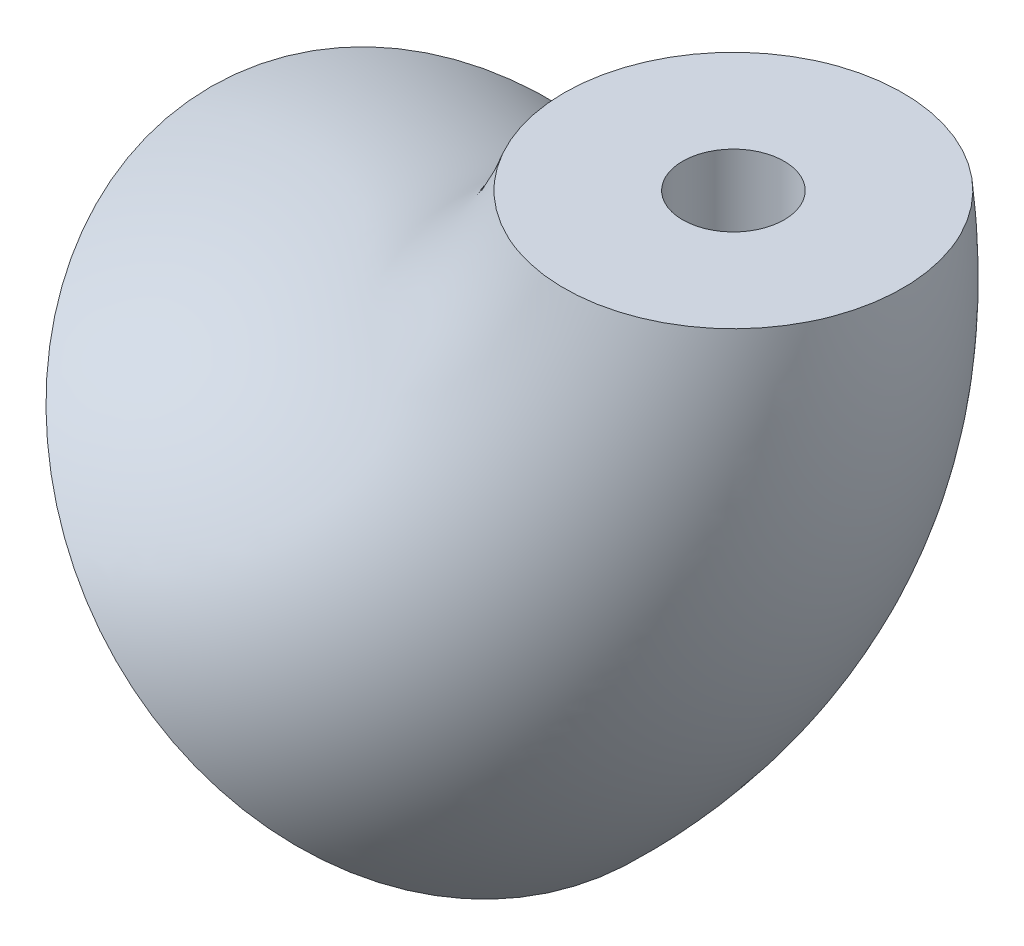
ISO-10303-21;
HEADER;
FILE_DESCRIPTION(('STEP AP214'),'2;1');
FILE_NAME('part.step','',(''),(''),'','','');
FILE_SCHEMA(('AUTOMOTIVE_DESIGN { 1 0 10303 214 1 1 1 1 }'));
ENDSEC;
DATA;
#1=APPLICATION_CONTEXT('core data for automotive mechanical design processes');
#2=APPLICATION_PROTOCOL_DEFINITION('international standard','automotive_design',2000,#1);
#3=PRODUCT_CONTEXT('',#1,'mechanical');
#4=PRODUCT('Part','Part','',(#3));
#5=PRODUCT_RELATED_PRODUCT_CATEGORY('part','',(#4));
#6=PRODUCT_DEFINITION_FORMATION('','',#4);
#7=PRODUCT_DEFINITION_CONTEXT('part definition',#1,'design');
#8=PRODUCT_DEFINITION('design','',#6,#7);
#9=PRODUCT_DEFINITION_SHAPE('','',#8);
#10=(LENGTH_UNIT() NAMED_UNIT(*) SI_UNIT(.MILLI.,.METRE.));
#11=(NAMED_UNIT(*) PLANE_ANGLE_UNIT() SI_UNIT($,.RADIAN.));
#12=(NAMED_UNIT(*) SI_UNIT($,.STERADIAN.) SOLID_ANGLE_UNIT());
#13=UNCERTAINTY_MEASURE_WITH_UNIT(LENGTH_MEASURE(1.E-05),#10,'distance_accuracy_value','');
#14=(GEOMETRIC_REPRESENTATION_CONTEXT(3) GLOBAL_UNCERTAINTY_ASSIGNED_CONTEXT((#13)) GLOBAL_UNIT_ASSIGNED_CONTEXT((#10,
#11,#12)) REPRESENTATION_CONTEXT('',''));
#15=CARTESIAN_POINT('',(0.,0.,0.));
#16=DIRECTION('',(0.,0.,1.));
#17=DIRECTION('',(1.,0.,0.));
#18=AXIS2_PLACEMENT_3D('',#15,#16,#17);
#19=CARTESIAN_POINT('',(1146.04163059245,750.255315422821,0.));
#20=DIRECTION('',(-0.731353701619166,-0.681998360062503,0.));
#21=DIRECTION('',(0.681998360062503,-0.731353701619166,0.));
#22=AXIS2_PLACEMENT_3D('',#19,#20,#21);
#23=PLANE('',#22);
#24=CARTESIAN_POINT('',(1146.04163059245,750.255315422821,0.));
#25=DIRECTION('',(-0.731353701619166,-0.681998360062503,0.));
#26=DIRECTION('',(0.681998360062503,-0.731353701619166,0.));
#27=AXIS2_PLACEMENT_3D('',#24,#25,#26);
#28=CIRCLE('',#27,9.21282401216281);
#29=CARTESIAN_POINT('',(1139.75849972461,756.993148366482,0.));
#30=VERTEX_POINT('',#29);
#31=EDGE_CURVE('E12',#30,#30,#28,.T.);
#32=ORIENTED_EDGE('',*,*,#31,.T.);
#33=EDGE_LOOP('',(#32));
#34=FACE_BOUND('',#33,.T.);
#35=ADVANCED_FACE('F103',(#34),#23,.T.);
#36=CARTESIAN_POINT('',(1155.18967768319,762.053259300769,0.));
#37=DIRECTION('',(0.,1.,0.));
#38=DIRECTION('',(0.,0.,1.));
#39=AXIS2_PLACEMENT_3D('',#36,#37,#38);
#40=PLANE('',#39);
#41=CARTESIAN_POINT('',(1155.18967768319,762.053259300769,0.));
#42=DIRECTION('',(0.,1.,0.));
#43=DIRECTION('',(0.,0.,1.));
#44=AXIS2_PLACEMENT_3D('',#41,#42,#43);
#45=CIRCLE('',#44,1.50000000000008);
#46=CARTESIAN_POINT('',(1155.18967768319,762.053259300769,1.50000000000008));
#47=VERTEX_POINT('',#46);
#48=EDGE_CURVE('E180',#47,#47,#45,.T.);
#49=ORIENTED_EDGE('',*,*,#48,.F.);
#50=EDGE_LOOP('',(#49));
#51=FACE_BOUND('',#50,.T.);
#52=CARTESIAN_POINT('',(1155.18967768319,762.053259300769,0.));
#53=DIRECTION('',(0.,1.,0.));
#54=DIRECTION('',(0.,0.,1.));
#55=AXIS2_PLACEMENT_3D('',#52,#53,#54);
#56=CIRCLE('',#55,4.99999999999982);
#57=CARTESIAN_POINT('',(1150.18967768319,762.053259300769,0.));
#58=VERTEX_POINT('',#57);
#59=EDGE_CURVE('E112',#58,#58,#56,.T.);
#60=ORIENTED_EDGE('',*,*,#59,.T.);
#61=EDGE_LOOP('',(#60));
#62=FACE_BOUND('',#61,.T.);
#63=ADVANCED_FACE('F136',(#51,#62),#40,.T.);
#64=CARTESIAN_POINT('',(1150.18967768319,762.053259300769,0.));
#65=CARTESIAN_POINT('',(1148.70749142818,757.778321869257,0.));
#66=CARTESIAN_POINT('',(1144.03343715613,755.510962111479,0.));
#67=CARTESIAN_POINT('',(1139.75849972461,756.993148366482,0.));
#68=CARTESIAN_POINT('',(1150.18967768319,762.053259300769,-0.654498464275008));
#69=CARTESIAN_POINT('',(1148.70749142818,757.778321869257,-0.838317587356443));
#70=CARTESIAN_POINT('',(1144.03343715613,755.510962111479,-1.02213671043788));
#71=CARTESIAN_POINT('',(1139.75849972461,756.993148366482,-1.20595583351932));
#72=CARTESIAN_POINT('',(1150.44970455818,762.053259300769,-1.96322622308587));
#73=CARTESIAN_POINT('',(1149.00920544388,757.717101960966,-2.51461963943124));
#74=CARTESIAN_POINT('',(1144.38804091517,755.335150493375,-3.0660130557766));
#75=CARTESIAN_POINT('',(1140.08526091517,756.642739890079,-3.61740647212197));
#76=CARTESIAN_POINT('',(1151.56202851706,762.05325930077,-3.62771208725002));
#77=CARTESIAN_POINT('',(1150.28960582695,757.425876070856,-4.64657999396316));
#78=CARTESIAN_POINT('',(1145.87852748238,754.552554457447,-5.66544790067631));
#79=CARTESIAN_POINT('',(1141.48308749716,755.143754401509,-6.68431580738946));
#80=CARTESIAN_POINT('',(1153.22632705192,762.053259300769,-4.73979573179859));
#81=CARTESIAN_POINT('',(1152.19833484904,756.970112175774,-6.07100526231663));
#82=CARTESIAN_POINT('',(1148.09050065559,753.360824709295,-7.40221479283468));
#83=CARTESIAN_POINT('',(1143.57446018439,752.901031770733,-8.73342432335272));
#84=CARTESIAN_POINT('',(1155.18967768319,762.05325930077,-5.13036592541417));
#85=CARTESIAN_POINT('',(1154.44627961897,756.42170422953,-6.57124353258663));
#86=CARTESIAN_POINT('',(1150.69025518008,751.943778007674,-8.0121211397591));
#87=CARTESIAN_POINT('',(1146.04163059245,750.255315422817,-9.45299874693156));
#88=CARTESIAN_POINT('',(1157.15302831445,762.053259300768,-4.73979573179842));
#89=CARTESIAN_POINT('',(1156.69422438889,755.873296283288,-6.07100526231648));
#90=CARTESIAN_POINT('',(1153.29000970458,750.526731306061,-7.40221479283455));
#91=CARTESIAN_POINT('',(1148.50880100052,747.609599074916,-8.73342432335262));
#92=CARTESIAN_POINT('',(1158.81732684932,762.05325930077,-3.62771208725009));
#93=CARTESIAN_POINT('',(1158.60295341098,755.417532388204,-4.64657999396326));
#94=CARTESIAN_POINT('',(1155.50198287779,749.335001557901,-5.66544790067643));
#95=CARTESIAN_POINT('',(1150.60017368774,745.366876444126,-6.6843158073896));
#96=CARTESIAN_POINT('',(1159.92965080818,762.053259300768,-1.96322622308575));
#97=CARTESIAN_POINT('',(1159.88335379405,755.126306498096,-2.51461963943113));
#98=CARTESIAN_POINT('',(1156.992469445,748.552405521979,-3.06601305577652));
#99=CARTESIAN_POINT('',(1151.99800026974,743.867890955567,-3.6174064721219));
#100=CARTESIAN_POINT('',(1160.18967768319,762.053259300769,-0.654498464275007));
#101=CARTESIAN_POINT('',(1160.18506780975,755.065086589804,-0.838317587356443));
#102=CARTESIAN_POINT('',(1157.34707320404,748.376593903873,-1.02213671043788));
#103=CARTESIAN_POINT('',(1152.32476146029,743.51748247916,-1.20595583351932));
#104=CARTESIAN_POINT('',(1160.18967768319,762.053259300769,0.654498464274996));
#105=CARTESIAN_POINT('',(1160.18506780975,755.065086589804,0.838317587356443));
#106=CARTESIAN_POINT('',(1157.34707320404,748.376593903873,1.02213671043788));
#107=CARTESIAN_POINT('',(1152.32476146029,743.51748247916,1.20595583351933));
#108=CARTESIAN_POINT('',(1159.92965080819,762.05325930077,1.96322622308566));
#109=CARTESIAN_POINT('',(1159.88335379405,755.126306498096,2.51461963943108));
#110=CARTESIAN_POINT('',(1156.992469445,748.552405521978,3.0660130557765));
#111=CARTESIAN_POINT('',(1151.99800026973,743.867890955564,3.61740647212193));
#112=CARTESIAN_POINT('',(1158.81732684932,762.053259300768,3.62771208725022));
#113=CARTESIAN_POINT('',(1158.60295341098,755.417532388204,4.64657999396331));
#114=CARTESIAN_POINT('',(1155.50198287779,749.335001557903,5.6654479006764));
#115=CARTESIAN_POINT('',(1150.60017368774,745.366876444129,6.68431580738949));
#116=CARTESIAN_POINT('',(1157.15302831445,762.05325930077,4.73979573179819));
#117=CARTESIAN_POINT('',(1156.69422438889,755.873296283289,6.07100526231633));
#118=CARTESIAN_POINT('',(1153.29000970458,750.52673130606,7.40221479283447));
#119=CARTESIAN_POINT('',(1148.50880100052,747.609599074913,8.73342432335262));
#120=CARTESIAN_POINT('',(1155.18967768319,762.05325930077,5.1303659254143));
#121=CARTESIAN_POINT('',(1154.44627961897,756.42170422953,6.57124353258674));
#122=CARTESIAN_POINT('',(1150.69025518008,751.943778007675,8.01212113975916));
#123=CARTESIAN_POINT('',(1146.04163059245,750.255315422819,9.4529987469316));
#124=CARTESIAN_POINT('',(1153.22632705192,762.053259300768,4.73979573179824));
#125=CARTESIAN_POINT('',(1152.19833484904,756.970112175773,6.07100526231634));
#126=CARTESIAN_POINT('',(1148.09050065559,753.360824709294,7.40221479283444));
#127=CARTESIAN_POINT('',(1143.57446018439,752.901031770732,8.73342432335254));
#128=CARTESIAN_POINT('',(1151.56202851705,762.053259300769,3.62771208725031));
#129=CARTESIAN_POINT('',(1150.28960582695,757.425876070856,4.64657999396335));
#130=CARTESIAN_POINT('',(1145.87852748238,754.552554457448,5.66544790067639));
#131=CARTESIAN_POINT('',(1141.48308749716,755.14375440151,6.68431580738943));
#132=CARTESIAN_POINT('',(1150.44970455819,762.053259300769,1.96322622308577));
#133=CARTESIAN_POINT('',(1149.00920544388,757.717101960966,2.51461963943118));
#134=CARTESIAN_POINT('',(1144.38804091517,755.335150493374,3.06601305577659));
#135=CARTESIAN_POINT('',(1140.08526091517,756.642739890078,3.617406472122));
#136=CARTESIAN_POINT('',(1150.18967768319,762.053259300769,0.654498464274995));
#137=CARTESIAN_POINT('',(1148.70749142818,757.778321869257,0.838317587356443));
#138=CARTESIAN_POINT('',(1144.03343715613,755.510962111479,1.02213671043788));
#139=CARTESIAN_POINT('',(1139.75849972461,756.993148366482,1.20595583351933));
#140=CARTESIAN_POINT('',(1150.18967768319,762.053259300769,0.));
#141=CARTESIAN_POINT('',(1148.70749142818,757.778321869257,0.));
#142=CARTESIAN_POINT('',(1144.03343715613,755.510962111479,0.));
#143=CARTESIAN_POINT('',(1139.75849972461,756.993148366482,0.));
#144=B_SPLINE_SURFACE_WITH_KNOTS('',3,3,((#64,#65,#66,#67),(#68,#69,#70,#71),(#72,#73,#74,#75),
(#76,#77,#78,#79),(#80,#81,#82,#83),(#84,#85,#86,#87),(#88,#89,#90,#91),(#92,#93,#94,#95),(#96,
#97,#98,#99),(#100,#101,#102,#103),(#104,#105,#106,#107),(#108,#109,#110,#111),(#112,#113,#114,
#115),(#116,#117,#118,#119),(#120,#121,#122,#123),(#124,#125,#126,#127),(#128,#129,#130,#131),
(#132,#133,#134,#135),(#136,#137,#138,#139),(#140,#141,#142,#143)),.UNSPECIFIED.,.T.,.F.,.F.,(4,
1,1,1,1,1,1,1,2,1,1,1,1,1,1,1,4),(4,4),(0.,0.0625,0.125,0.1875,0.25,0.3125,0.375,0.4375,0.5,
0.5625,0.625,0.6875,0.75,0.8125,0.875,0.9375,1.),(0.,1.),.UNSPECIFIED.);
#145=CARTESIAN_POINT('',(1150.18967768319,762.053259300769,0.));
#146=CARTESIAN_POINT('',(1150.18389212913,762.036572539112,0.));
#147=CARTESIAN_POINT('',(1150.17805369045,762.019904112294,0.));
#148=CARTESIAN_POINT('',(1150.16627968007,761.986628787414,0.));
#149=CARTESIAN_POINT('',(1150.16034426145,761.970021835186,0.));
#150=CARTESIAN_POINT('',(1150.1483767199,761.936869667366,0.));
#151=CARTESIAN_POINT('',(1150.14234474749,761.92032439744,0.));
#152=CARTESIAN_POINT('',(1150.13018452952,761.887295802029,0.));
#153=CARTESIAN_POINT('',(1150.12405643193,761.870812422065,0.));
#154=CARTESIAN_POINT('',(1150.11170439409,761.837907814373,0.));
#155=CARTESIAN_POINT('',(1150.10548059928,761.821486532045,0.));
#156=CARTESIAN_POINT('',(1150.09293759764,761.788706327392,0.));
#157=CARTESIAN_POINT('',(1150.08661853375,761.77234735037,0.));
#158=CARTESIAN_POINT('',(1150.07388542451,761.739691964072,0.));
#159=CARTESIAN_POINT('',(1150.06747151962,761.723395500026,0.));
#160=CARTESIAN_POINT('',(1150.05454915895,761.690865347402,0.));
#161=CARTESIAN_POINT('',(1150.04804084116,761.674631604002,0.));
#162=CARTESIAN_POINT('',(1150.03493008522,761.642227100367,0.));
#163=CARTESIAN_POINT('',(1150.02832778264,761.626056285282,0.));
#164=CARTESIAN_POINT('',(1150.01502948761,761.593777845953,0.));
#165=CARTESIAN_POINT('',(1150.00833362833,761.577670166852,0.));
#166=CARTESIAN_POINT('',(1149.99484865038,761.545518207146,0.));
#167=CARTESIAN_POINT('',(1149.98805966249,761.529473871697,0.));
#168=CARTESIAN_POINT('',(1149.9743888578,761.497448806929,0.));
#169=CARTESIAN_POINT('',(1149.9675071694,761.481468022801,0.));
#170=CARTESIAN_POINT('',(1149.95365139414,761.449570268287,0.));
#171=CARTESIAN_POINT('',(1149.94667743333,761.433653243147,0.));
#172=CARTESIAN_POINT('',(1149.93263754367,761.401883214201,0.));
#173=CARTESIAN_POINT('',(1149.92557173855,761.386030155716,0.));
#174=CARTESIAN_POINT('',(1149.91134859066,761.354388267654,0.));
#175=CARTESIAN_POINT('',(1149.90419136933,761.338599383492,0.));
#176=CARTESIAN_POINT('',(1149.88978581938,761.307086051627,0.));
#177=CARTESIAN_POINT('',(1149.88253760993,761.291361549454,0.));
#178=CARTESIAN_POINT('',(1149.86795051409,761.259977189102,0.));
#179=CARTESIAN_POINT('',(1149.86061174462,761.244317276583,0.));
#180=CARTESIAN_POINT('',(1149.84584395907,761.213062303057,0.));
#181=CARTESIAN_POINT('',(1149.83841505768,761.197467187859,0.));
#182=CARTESIAN_POINT('',(1149.82346743859,761.166342016472,0.));
#183=CARTESIAN_POINT('',(1149.81594883337,761.15081190626,0.));
#184=CARTESIAN_POINT('',(1149.80082223691,761.119816952325,0.));
#185=CARTESIAN_POINT('',(1149.79321435597,761.104352054764,0.));
#186=CARTESIAN_POINT('',(1149.7779096383,761.073487733596,0.));
#187=CARTESIAN_POINT('',(1149.77021290973,761.05808825635,0.));
#188=CARTESIAN_POINT('',(1149.75473092703,761.027354983259,0.));
#189=CARTESIAN_POINT('',(1149.74694577894,761.012021133993,0.));
#190=CARTESIAN_POINT('',(1149.73128738737,760.981419324293,0.));
#191=CARTESIAN_POINT('',(1149.72341424785,760.96615131067,0.));
#192=CARTESIAN_POINT('',(1149.70758030359,760.935681379673,0.));
#193=CARTESIAN_POINT('',(1149.69961960073,760.920479409357,0.));
#194=CARTESIAN_POINT('',(1149.68361095995,760.890141772374,0.));
#195=CARTESIAN_POINT('',(1149.67556312186,760.875006053028,0.));
#196=CARTESIAN_POINT('',(1149.65938064073,760.84480112537,0.));
#197=CARTESIAN_POINT('',(1149.6512460955,760.829731864657,0.));
#198=CARTESIAN_POINT('',(1149.63489063018,760.799660061636,0.));
#199=CARTESIAN_POINT('',(1149.62666980591,760.784657467218,0.));
#200=CARTESIAN_POINT('',(1149.61014221258,760.754719204145,0.));
#201=CARTESIAN_POINT('',(1149.60183553737,760.739783483684,0.));
#202=CARTESIAN_POINT('',(1149.5851366722,760.70997917587,0.));
#203=CARTESIAN_POINT('',(1149.57674457414,760.695110537027,0.));
#204=CARTESIAN_POINT('',(1149.55987529329,760.665440599782,0.));
#205=CARTESIAN_POINT('',(1149.55139820049,760.650639250219,0.));
#206=CARTESIAN_POINT('',(1149.53435936013,760.621104098853,0.));
#207=CARTESIAN_POINT('',(1149.52579770067,760.606370246231,0.));
#208=CARTESIAN_POINT('',(1149.50859015698,760.576970296054,0.));
#209=CARTESIAN_POINT('',(1149.49994435897,760.562304148033,0.));
#210=CARTESIAN_POINT('',(1149.48256896811,760.533039814355,0.));
#211=CARTESIAN_POINT('',(1149.47383945964,760.518441578596,0.));
#212=CARTESIAN_POINT('',(1149.45629707778,760.489313276726,0.));
#213=CARTESIAN_POINT('',(1149.44748428695,760.47478316089,0.));
#214=CARTESIAN_POINT('',(1149.42977577025,760.445791306137,0.));
#215=CARTESIAN_POINT('',(1149.42088012516,760.431329517882,0.));
#216=CARTESIAN_POINT('',(1149.4030063298,760.402474525555,0.));
#217=CARTESIAN_POINT('',(1149.39402825854,760.388081272541,0.));
#218=CARTESIAN_POINT('',(1149.37599004067,760.35936355795,0.));
#219=CARTESIAN_POINT('',(1149.36692997134,760.345039047835,0.));
#220=CARTESIAN_POINT('',(1149.34872818715,760.316459026288,0.));
#221=CARTESIAN_POINT('',(1149.33958654785,760.302203466732,0.));
#222=CARTESIAN_POINT('',(1149.32122205349,760.273761553537,0.));
#223=CARTESIAN_POINT('',(1149.3119992723,760.259575152199,0.));
#224=CARTESIAN_POINT('',(1149.29347292395,760.231271762664,0.));
#225=CARTESIAN_POINT('',(1149.28416942898,760.217154727201,0.));
#226=CARTESIAN_POINT('',(1149.26548208279,760.188990276634,0.));
#227=CARTESIAN_POINT('',(1149.25609830214,760.174942814704,0.));
#228=CARTESIAN_POINT('',(1149.23725081428,760.146917718414,0.));
#229=CARTESIAN_POINT('',(1149.22778717604,760.132940037675,0.));
#230=CARTESIAN_POINT('',(1149.20878040268,760.105054710969,0.));
#231=CARTESIAN_POINT('',(1149.19923733495,760.091147019078,0.));
#232=CARTESIAN_POINT('',(1149.18007213225,760.063401877263,0.));
#233=CARTESIAN_POINT('',(1149.17045006312,760.049564381878,0.));
#234=CARTESIAN_POINT('',(1149.15112728725,760.021959840261,0.));
#235=CARTESIAN_POINT('',(1149.14142664481,760.008192749038,0.));
#236=CARTESIAN_POINT('',(1149.12194715194,759.980729222927,0.));
#237=CARTESIAN_POINT('',(1149.11216836429,759.967032743523,0.));
#238=CARTESIAN_POINT('',(1149.09253301058,759.939710648225,0.));
#239=CARTESIAN_POINT('',(1149.08267650581,759.926084988296,0.));
#240=CARTESIAN_POINT('',(1149.06288614743,759.898904739117,0.));
#241=CARTESIAN_POINT('',(1149.05295235363,759.88535010632,0.));
#242=CARTESIAN_POINT('',(1149.03300784674,759.858312118567,0.));
#243=CARTESIAN_POINT('',(1149.02299719202,759.844828720558,0.));
#244=CARTESIAN_POINT('',(1149.00289939278,759.817933409538,0.));
#245=CARTESIAN_POINT('',(1148.99281230522,759.804521453971,0.));
#246=CARTESIAN_POINT('',(1148.9725620698,759.777769234991,0.));
#247=CARTESIAN_POINT('',(1148.9623989775,759.764428929523,0.));
#248=CARTESIAN_POINT('',(1148.94199716206,759.737820217888,0.));
#249=CARTESIAN_POINT('',(1148.93175849311,759.724551770174,0.));
#250=CARTESIAN_POINT('',(1148.91120595381,759.69808698119,0.));
#251=CARTESIAN_POINT('',(1148.90089213631,759.684890598886,0.));
#252=CARTESIAN_POINT('',(1148.88018972932,759.65857014786,0.));
#253=CARTESIAN_POINT('',(1148.86980119135,759.645446038619,0.));
#254=CARTESIAN_POINT('',(1148.84894977283,759.619270340858,0.));
#255=CARTESIAN_POINT('',(1148.8384869425,759.606218712336,0.));
#256=CARTESIAN_POINT('',(1148.81748736861,759.580188183145,0.));
#257=CARTESIAN_POINT('',(1148.80695067399,759.567209242996,0.));
#258=CARTESIAN_POINT('',(1148.7858038009,759.54132429768,0.));
#259=CARTESIAN_POINT('',(1148.7751936701,759.528418253559,0.));
#260=CARTESIAN_POINT('',(1148.75390035396,759.502679307425,0.));
#261=CARTESIAN_POINT('',(1148.74321721507,759.489846366985,0.));
#262=CARTESIAN_POINT('',(1148.72177831205,759.464253835338,0.));
#263=CARTESIAN_POINT('',(1148.71102259315,759.451494206235,0.));
#264=CARTESIAN_POINT('',(1148.68943895941,759.426048504381,0.));
#265=CARTESIAN_POINT('',(1148.6786110886,759.413362394268,0.));
#266=CARTESIAN_POINT('',(1148.6568835803,759.388063937512,0.));
#267=CARTESIAN_POINT('',(1148.64598398568,759.375451554042,0.));
#268=CARTESIAN_POINT('',(1148.62411345897,759.35030075769,0.));
#269=CARTESIAN_POINT('',(1148.61314256862,759.337762308518,0.));
#270=CARTESIAN_POINT('',(1148.59112987968,759.312759587875,0.));
#271=CARTESIAN_POINT('',(1148.58008812169,759.300295280655,0.));
#272=CARTESIAN_POINT('',(1148.55793412666,759.275441051026,0.));
#273=CARTESIAN_POINT('',(1148.54682192913,759.26305109341,0.));
#274=CARTESIAN_POINT('',(1148.52452748418,759.238345770102,0.));
#275=CARTESIAN_POINT('',(1148.51334527519,759.226030369743,0.));
#276=CARTESIAN_POINT('',(1148.49091123649,759.20147436806,0.));
#277=CARTESIAN_POINT('',(1148.47965944413,759.189233732613,0.));
#278=CARTESIAN_POINT('',(1148.45708666782,759.16482746786,0.));
#279=CARTESIAN_POINT('',(1148.44576572018,759.152661804977,0.));
#280=CARTESIAN_POINT('',(1148.42305506244,759.128405692461,0.));
#281=CARTESIAN_POINT('',(1148.41166538761,759.116315209795,0.));
#282=CARTESIAN_POINT('',(1148.38881770458,759.092209664819,0.));
#283=CARTESIAN_POINT('',(1148.37735973065,759.080194570024,0.));
#284=CARTESIAN_POINT('',(1148.3543758785,759.056240007895,0.));
#285=CARTESIAN_POINT('',(1148.34285003356,759.044300508622,0.));
#286=CARTESIAN_POINT('',(1148.31973086844,759.020497344645,0.));
#287=CARTESIAN_POINT('',(1148.30813758058,759.008633648548,0.));
#288=CARTESIAN_POINT('',(1148.28488395865,758.984982298028,0.));
#289=CARTESIAN_POINT('',(1148.27322365596,758.97319461276,0.));
#290=CARTESIAN_POINT('',(1148.24983643338,758.949695491002,0.));
#291=CARTESIAN_POINT('',(1148.23810954394,758.937984024216,0.));
#292=CARTESIAN_POINT('',(1148.21458957687,758.914637546525,0.));
#293=CARTESIAN_POINT('',(1148.20279652877,758.903002505872,0.));
#294=CARTESIAN_POINT('',(1148.17914467336,758.879809087554,0.));
#295=CARTESIAN_POINT('',(1148.16728589469,758.868250680688,0.));
#296=CARTESIAN_POINT('',(1148.14350300711,758.845210737048,0.));
#297=CARTESIAN_POINT('',(1148.13157892595,758.833729171622,0.));
#298=CARTESIAN_POINT('',(1148.10766586234,758.810843117965,0.));
#299=CARTESIAN_POINT('',(1148.09567690679,758.799438601631,0.));
#300=CARTESIAN_POINT('',(1148.07163452332,758.776706853263,0.));
#301=CARTESIAN_POINT('',(1148.05958112146,758.765379593672,0.));
#302=CARTESIAN_POINT('',(1148.03541027428,758.742802565899,0.));
#303=CARTESIAN_POINT('',(1148.02329285419,758.731552770705,0.));
#304=CARTESIAN_POINT('',(1147.99899439945,758.709130878831,0.));
#305=CARTESIAN_POINT('',(1147.98681338923,758.697958755687,0.));
#306=CARTESIAN_POINT('',(1147.9623881831,758.675692415018,0.));
#307=CARTESIAN_POINT('',(1147.95014401082,758.664598171575,0.));
#308=CARTESIAN_POINT('',(1147.92559290944,758.642487797417,0.));
#309=CARTESIAN_POINT('',(1147.9132860032,758.631471641329,0.));
#310=CARTESIAN_POINT('',(1147.88860986274,758.609517648987,0.));
#311=CARTESIAN_POINT('',(1147.87624065061,758.598579787906,0.));
#312=CARTESIAN_POINT('',(1147.85144032722,758.576782592686,0.));
#313=CARTESIAN_POINT('',(1147.8390092373,758.565923234264,0.));
#314=CARTESIAN_POINT('',(1147.81408558713,758.544283251471,0.));
#315=CARTESIAN_POINT('',(1147.80159304749,758.533502603362,0.));
#316=CARTESIAN_POINT('',(1147.7765469267,758.512020248303,0.));
#317=CARTESIAN_POINT('',(1147.76399336544,758.501318518158,0.));
#318=CARTESIAN_POINT('',(1147.73882563018,758.479994206138,0.));
#319=CARTESIAN_POINT('',(1147.72621147537,758.469371601609,0.));
#320=CARTESIAN_POINT('',(1147.7009229818,758.448205747935,0.));
#321=CARTESIAN_POINT('',(1147.68824866153,758.437662476676,0.));
#322=CARTESIAN_POINT('',(1147.6628402658,758.416655496654,0.));
#323=CARTESIAN_POINT('',(1147.65010620816,758.406191766317,0.));
#324=CARTESIAN_POINT('',(1147.62457876642,758.385344075252,0.));
#325=CARTESIAN_POINT('',(1147.61178539949,758.37496009349,0.));
#326=CARTESIAN_POINT('',(1147.58613976789,758.354272106689,0.));
#327=CARTESIAN_POINT('',(1147.57328751975,758.343968081155,0.));
#328=CARTESIAN_POINT('',(1147.54752455446,758.323440213924,0.));
#329=CARTESIAN_POINT('',(1147.53461385319,758.313216352271,0.));
#330=CARTESIAN_POINT('',(1147.50873441035,758.292849019916,0.));
#331=CARTESIAN_POINT('',(1147.49576568405,758.282705529796,0.));
#332=CARTESIAN_POINT('',(1147.4697706198,758.262499147625,0.));
#333=CARTESIAN_POINT('',(1147.45674429654,758.252436236691,0.));
#334=CARTESIAN_POINT('',(1147.43063446706,758.23239122001,0.));
#335=CARTESIAN_POINT('',(1147.41755097492,758.222409095916,0.));
#336=CARTESIAN_POINT('',(1147.39132723635,758.20252586003,0.));
#337=CARTESIAN_POINT('',(1147.37818700341,758.192624730429,0.));
#338=CARTESIAN_POINT('',(1147.3518502119,758.172903690647,0.));
#339=CARTESIAN_POINT('',(1147.33865366626,758.163083763191,0.));
#340=CARTESIAN_POINT('',(1147.31220467796,758.14352533482,0.));
#341=CARTESIAN_POINT('',(1147.29895224768,758.133786817163,0.));
#342=CARTESIAN_POINT('',(1147.27239191874,758.114391415509,0.));
#343=CARTESIAN_POINT('',(1147.25908403192,758.104734515304,0.));
#344=CARTESIAN_POINT('',(1147.2324132185,758.085502555675,0.));
#345=CARTESIAN_POINT('',(1147.21905030321,758.075927480576,0.));
#346=CARTESIAN_POINT('',(1147.19226986146,758.056859378279,0.));
#347=CARTESIAN_POINT('',(1147.17885234578,758.047366335939,0.));
#348=CARTESIAN_POINT('',(1147.15196313185,758.028462506282,0.));
#349=CARTESIAN_POINT('',(1147.13849144386,758.019051704355,0.));
#350=CARTESIAN_POINT('',(1147.1114943139,758.000312562645,0.));
#351=CARTESIAN_POINT('',(1147.09796888169,757.990984208784,0.));
#352=CARTESIAN_POINT('',(1147.07086469184,757.972410170329,0.));
#353=CARTESIAN_POINT('',(1147.05728594349,757.963164472189,0.));
#354=CARTESIAN_POINT('',(1147.03007554992,757.944755952298,0.));
#355=CARTESIAN_POINT('',(1147.0164439135,757.935593117532,0.));
#356=CARTESIAN_POINT('',(1146.98912817235,757.917350531512,0.));
#357=CARTESIAN_POINT('',(1146.97544407595,757.908270767774,0.));
#358=CARTESIAN_POINT('',(1146.94802384336,757.890194530933,0.));
#359=CARTESIAN_POINT('',(1146.93428771506,757.881198045879,0.));
#360=CARTESIAN_POINT('',(1146.9067638472,757.863288573525,0.));
#361=CARTESIAN_POINT('',(1146.89297611507,757.854375574808,0.));
#362=CARTESIAN_POINT('',(1146.86534946807,757.836633282251,0.));
#363=CARTESIAN_POINT('',(1146.8515105602,757.827803977525,0.));
#364=CARTESIAN_POINT('',(1146.82378199023,757.810229280073,0.));
#365=CARTESIAN_POINT('',(1146.80989233469,757.801483876993,0.));
#366=CARTESIAN_POINT('',(1146.78206269789,757.784077189955,0.));
#367=CARTESIAN_POINT('',(1146.76812272276,757.775415896176,0.));
#368=CARTESIAN_POINT('',(1146.74019287528,757.758177634861,0.));
#369=CARTESIAN_POINT('',(1146.72620300865,757.749600658038,0.));
#370=CARTESIAN_POINT('',(1146.69817380663,757.732531237755,0.));
#371=CARTESIAN_POINT('',(1146.68413447657,757.724038785542,0.));
#372=CARTESIAN_POINT('',(1146.65600677617,757.707138621601,0.));
#373=CARTESIAN_POINT('',(1146.64191841076,757.698730901654,0.));
#374=CARTESIAN_POINT('',(1146.61369306813,757.682000409364,0.));
#375=CARTESIAN_POINT('',(1146.59955609545,757.673677629339,0.));
#376=CARTESIAN_POINT('',(1146.57123396673,757.65711722401,0.));
#377=CARTESIAN_POINT('',(1146.55704881486,757.648879591561,0.));
#378=CARTESIAN_POINT('',(1146.5286307562,757.632489688503,0.));
#379=CARTESIAN_POINT('',(1146.51439785321,757.624337411286,0.));
#380=CARTESIAN_POINT('',(1146.48588472076,757.608118425808,0.));
#381=CARTESIAN_POINT('',(1146.47160449474,757.60005171148,0.));
#382=CARTESIAN_POINT('',(1146.44299714465,757.584004058894,0.));
#383=CARTESIAN_POINT('',(1146.42867002368,757.576023115109,0.));
#384=CARTESIAN_POINT('',(1146.39996931209,757.560147210725,0.));
#385=CARTESIAN_POINT('',(1146.38559572423,757.552252245141,0.));
#386=CARTESIAN_POINT('',(1146.3568025073,757.536548504268,0.));
#387=CARTESIAN_POINT('',(1146.34238288064,757.528739724541,0.));
#388=CARTESIAN_POINT('',(1146.31349801451,757.513208562491,0.));
#389=CARTESIAN_POINT('',(1146.29903277713,757.505486176276,0.));
#390=CARTESIAN_POINT('',(1146.27005711795,757.490128008361,0.));
#391=CARTESIAN_POINT('',(1146.25554669792,757.482492223316,0.));
#392=CARTESIAN_POINT('',(1146.22648110184,757.467307464846,0.));
#393=CARTESIAN_POINT('',(1146.21192592724,757.459758488628,0.));
#394=CARTESIAN_POINT('',(1146.1827712504,757.444747554915,0.));
#395=CARTESIAN_POINT('',(1146.16817174931,757.43728559518,0.));
#396=CARTESIAN_POINT('',(1146.13892884787,757.422448901535,0.));
#397=CARTESIAN_POINT('',(1146.12428544836,757.415074165941,0.));
#398=CARTESIAN_POINT('',(1146.09495517845,757.400412127676,0.));
#399=CARTESIAN_POINT('',(1146.08026830861,757.393124823879,0.));
#400=CARTESIAN_POINT('',(1146.05085152639,757.378637856307,0.));
#401=CARTESIAN_POINT('',(1146.03612161429,757.371438191966,0.));
#402=CARTESIAN_POINT('',(1146.0066191759,757.357126710398,0.));
#403=CARTESIAN_POINT('',(1145.99184664961,757.350014893171,0.));
#404=CARTESIAN_POINT('',(1145.9622594112,757.33587931292,0.));
#405=CARTESIAN_POINT('',(1145.9474446988,757.328855550464,0.));
#406=CARTESIAN_POINT('',(1145.91777351652,757.314896286842,0.));
#407=CARTESIAN_POINT('',(1145.90291704609,757.307960786816,0.));
#408=CARTESIAN_POINT('',(1145.87316277608,757.294178255136,0.));
#409=CARTESIAN_POINT('',(1145.8582649757,757.287331225198,0.));
#410=CARTESIAN_POINT('',(1145.82842847411,757.273725840774,0.));
#411=CARTESIAN_POINT('',(1145.81348977185,757.266967488581,0.));
#412=CARTESIAN_POINT('',(1145.78357189483,757.253539666726,0.));
#413=CARTESIAN_POINT('',(1145.76859271877,757.246870199939,0.));
#414=CARTESIAN_POINT('',(1145.73859432245,757.233620355966,0.));
#415=CARTESIAN_POINT('',(1145.72357510067,757.227039982243,0.));
#416=CARTESIAN_POINT('',(1145.69349704122,757.213968531466,0.));
#417=CARTESIAN_POINT('',(1145.67843820178,757.207477458466,0.));
#418=CARTESIAN_POINT('',(1145.64828133533,757.194584816198,0.));
#419=CARTESIAN_POINT('',(1145.63318330633,757.188183251581,0.));
#420=CARTESIAN_POINT('',(1145.60294848903,757.175469833137,0.));
#421=CARTESIAN_POINT('',(1145.58781169853,757.169157984562,0.));
#422=CARTESIAN_POINT('',(1145.55749978652,757.156624205257,0.));
#423=CARTESIAN_POINT('',(1145.5423246626,757.150402280383,0.));
#424=CARTESIAN_POINT('',(1145.51193651204,757.138048555531,0.));
#425=CARTESIAN_POINT('',(1145.49672348278,757.131916762019,0.));
#426=CARTESIAN_POINT('',(1145.46625994981,757.119743506935,0.));
#427=CARTESIAN_POINT('',(1145.45100944327,757.113702052445,0.));
#428=CARTESIAN_POINT('',(1145.42047138404,757.101709682444,0.));
#429=CARTESIAN_POINT('',(1145.40518382831,757.095758774636,0.));
#430=CARTESIAN_POINT('',(1145.37457209896,757.083947705033,0.));
#431=CARTESIAN_POINT('',(1145.35924792211,757.078087551569,0.));
#432=CARTESIAN_POINT('',(1145.32856337879,757.066458197679,0.));
#433=CARTESIAN_POINT('',(1145.3132030089,757.060689006218,0.));
#434=CARTESIAN_POINT('',(1145.28244650775,757.049241783357,0.));
#435=CARTESIAN_POINT('',(1145.2670503729,757.043563761562,0.));
#436=CARTESIAN_POINT('',(1145.23622277006,757.032299085046,0.));
#437=CARTESIAN_POINT('',(1145.22079129833,757.026712440577,0.));
#438=CARTESIAN_POINT('',(1145.18989344995,757.015630725723,0.));
#439=CARTESIAN_POINT('',(1145.1744270694,757.010135666242,0.));
#440=CARTESIAN_POINT('',(1145.14345983164,756.999237328365,0.));
#441=CARTESIAN_POINT('',(1145.12795897035,756.993834061533,0.));
#442=CARTESIAN_POINT('',(1145.09692319934,756.983119515951,0.));
#443=CARTESIAN_POINT('',(1145.0813882854,756.977808249431,0.));
#444=CARTESIAN_POINT('',(1145.05028483729,756.96727791146,0.));
#445=CARTESIAN_POINT('',(1145.03471629875,756.962058852913,0.));
#446=CARTESIAN_POINT('',(1145.00354602969,756.95171313787,0.));
#447=CARTESIAN_POINT('',(1144.98794429465,756.94658649496,0.));
#448=CARTESIAN_POINT('',(1144.95670806078,756.936425818163,0.));
#449=CARTESIAN_POINT('',(1144.9410735573,756.931391798551,0.));
#450=CARTESIAN_POINT('',(1144.90977221477,756.921416575317,0.));
#451=CARTESIAN_POINT('',(1144.89410537094,756.916475386666,0.));
#452=CARTESIAN_POINT('',(1144.86273977588,756.906686032314,0.));
#453=CARTESIAN_POINT('',(1144.84704101977,756.901837882287,0.));
#454=CARTESIAN_POINT('',(1144.81561202835,756.892234812134,0.));
#455=CARTESIAN_POINT('',(1144.79988178803,756.887479908395,0.));
#456=CARTESIAN_POINT('',(1144.76839025638,756.878063537759,0.));
#457=CARTESIAN_POINT('',(1144.75262895993,756.873402087972,0.));
#458=CARTESIAN_POINT('',(1144.7210757442,756.864172832172,0.));
#459=CARTESIAN_POINT('',(1144.70528381969,756.859605044,0.));
#460=CARTESIAN_POINT('',(1144.67366977603,756.850563318354,0.));
#461=CARTESIAN_POINT('',(1144.65784765155,756.846089399461,0.));
#462=CARTESIAN_POINT('',(1144.62617363609,756.837235619289,0.));
#463=CARTESIAN_POINT('',(1144.61032173971,756.832855777339,0.));
#464=CARTESIAN_POINT('',(1144.57858860861,756.82419035796,0.));
#465=CARTESIAN_POINT('',(1144.56270736841,756.819904800617,0.));
#466=CARTESIAN_POINT('',(1144.53091597781,756.811428157351,0.));
#467=CARTESIAN_POINT('',(1144.51500582185,756.80723709228,0.));
#468=CARTESIAN_POINT('',(1144.4831570279,756.798949640446,0.));
#469=CARTESIAN_POINT('',(1144.46721838427,756.794853275312,0.));
#470=CARTESIAN_POINT('',(1144.43531304312,756.78675543023,0.));
#471=CARTESIAN_POINT('',(1144.41934633989,756.782753972698,0.));
#472=CARTESIAN_POINT('',(1144.38738530767,756.774846149688,0.));
#473=CARTESIAN_POINT('',(1144.37139097293,756.770939807424,0.));
#474=CARTESIAN_POINT('',(1144.33937510579,756.763222421807,0.));
#475=CARTESIAN_POINT('',(1144.32335356761,756.759411402476,0.));
#476=CARTESIAN_POINT('',(1144.2912837217,756.751884869571,0.));
#477=CARTESIAN_POINT('',(1144.27523540815,756.748169380839,0.));
#478=CARTESIAN_POINT('',(1144.24311243962,756.740834115969,0.));
#479=CARTESIAN_POINT('',(1144.22703777878,756.737214365501,0.));
#480=CARTESIAN_POINT('',(1144.19486254377,756.730070783986,0.));
#481=CARTESIAN_POINT('',(1144.17876196372,756.726546979449,0.));
#482=CARTESIAN_POINT('',(1144.14653531838,756.719595496611,0.));
#483=CARTESIAN_POINT('',(1144.13040924719,756.716167845671,0.));
#484=CARTESIAN_POINT('',(1144.09813204766,756.709408876831,0.));
#485=CARTESIAN_POINT('',(1144.08198091341,756.706077587155,0.));
#486=CARTESIAN_POINT('',(1144.04965401585,756.699511547635,0.));
#487=CARTESIAN_POINT('',(1144.03347824662,756.69627682689,0.));
#488=CARTESIAN_POINT('',(1144.00110250716,756.689904132013,0.));
#489=CARTESIAN_POINT('',(1143.98490253102,756.686766187865,0.));
#490=CARTESIAN_POINT('',(1143.95247880582,756.680587252951,0.));
#491=CARTESIAN_POINT('',(1143.93625505086,756.677546293069,0.));
#492=CARTESIAN_POINT('',(1143.90378419605,756.671561533443,0.));
#493=CARTESIAN_POINT('',(1143.88753709034,756.668617765492,0.));
#494=CARTESIAN_POINT('',(1143.85501996207,756.662827596476,0.));
#495=CARTESIAN_POINT('',(1143.83874993369,756.659981228126,0.));
#496=CARTESIAN_POINT('',(1143.80618738812,756.654386065042,0.));
#497=CARTESIAN_POINT('',(1143.78989486515,756.65163730396,0.));
#498=CARTESIAN_POINT('',(1143.75728775841,756.646237562133,0.));
#499=CARTESIAN_POINT('',(1143.74097316892,756.643586615987,0.));
#500=CARTESIAN_POINT('',(1143.70832235717,756.638382710739,0.));
#501=CARTESIAN_POINT('',(1143.69198612925,756.635829787197,0.));
#502=CARTESIAN_POINT('',(1143.65929246863,756.630822133852,0.));
#503=CARTESIAN_POINT('',(1143.64293503034,756.628367440583,0.));
#504=CARTESIAN_POINT('',(1143.61019937701,756.623556454466,0.));
#505=CARTESIAN_POINT('',(1143.59382115644,756.621200199138,0.));
#506=CARTESIAN_POINT('',(1143.56104436653,756.616586295572,0.));
#507=CARTESIAN_POINT('',(1143.54464579176,756.614328685855,0.));
#508=CARTESIAN_POINT('',(1143.51182872142,756.609912280164,0.));
#509=CARTESIAN_POINT('',(1143.49541022053,756.607753523726,0.));
#510=CARTESIAN_POINT('',(1143.46255372592,756.603535031236,0.));
#511=CARTESIAN_POINT('',(1143.44611572698,756.601475335747,0.));
#512=CARTESIAN_POINT('',(1143.41322066423,756.597455171781,0.));
#513=CARTESIAN_POINT('',(1143.39676359533,756.59549474491,0.));
#514=CARTESIAN_POINT('',(1143.3638308206,756.591673324795,0.));
#515=CARTESIAN_POINT('',(1143.34735510982,756.589812374212,0.));
#516=CARTESIAN_POINT('',(1143.31438547925,756.586190113272,0.));
#517=CARTESIAN_POINT('',(1143.29789155466,756.584428846646,0.));
#518=CARTESIAN_POINT('',(1143.2648859244,756.581006160207,0.));
#519=CARTESIAN_POINT('',(1143.24837421409,756.579344785209,0.));
#520=CARTESIAN_POINT('',(1143.21533344029,756.576122088596,0.));
#521=CARTESIAN_POINT('',(1143.19880437233,756.574560812896,0.));
#522=CARTESIAN_POINT('',(1143.16572931114,756.571538521435,0.));
#523=CARTESIAN_POINT('',(1143.14918331361,756.570077552702,0.));
#524=CARTESIAN_POINT('',(1143.11607482118,756.56725608172,0.));
#525=CARTESIAN_POINT('',(1143.09951232217,756.565895627626,0.));
#526=CARTESIAN_POINT('',(1143.06637125464,756.563275392448,0.));
#527=CARTESIAN_POINT('',(1143.04979268223,756.562015660663,0.));
#528=CARTESIAN_POINT('',(1143.01661989575,756.559597076617,0.));
#529=CARTESIAN_POINT('',(1143.00002567801,756.558438274812,0.));
#530=CARTESIAN_POINT('',(1142.96682202874,756.556221757223,0.));
#531=CARTESIAN_POINT('',(1142.95021259376,756.555164093069,0.));
#532=CARTESIAN_POINT('',(1142.91697893784,756.553150057265,0.));
#533=CARTESIAN_POINT('',(1142.9003547137,756.552193738432,0.));
#534=CARTESIAN_POINT('',(1142.86709190729,756.55038259974,0.));
#535=CARTESIAN_POINT('',(1142.85045332207,756.5495278339,0.));
#536=CARTESIAN_POINT('',(1142.8171622213,756.547920007647,0.));
#537=CARTESIAN_POINT('',(1142.80050970309,756.547167002472,0.));
#538=CARTESIAN_POINT('',(1142.76719116412,756.545762903985,0.));
#539=CARTESIAN_POINT('',(1142.75052514099,756.545111867146,0.));
#540=CARTESIAN_POINT('',(1142.71718001997,756.543911911753,0.));
#541=CARTESIAN_POINT('',(1142.70050092001,756.543363050922,0.));
#542=CARTESIAN_POINT('',(1142.6671300731,756.542367653951,0.));
#543=CARTESIAN_POINT('',(1142.65043832439,756.541921176798,0.));
#544=CARTESIAN_POINT('',(1142.61704260772,756.541130753578,0.));
#545=CARTESIAN_POINT('',(1142.60033863835,756.540786867776,0.));
#546=CARTESIAN_POINT('',(1142.56691890808,756.540201833633,0.));
#547=CARTESIAN_POINT('',(1142.55020314612,756.539960746855,0.));
#548=CARTESIAN_POINT('',(1142.51676025841,756.539581517119,0.));
#549=CARTESIAN_POINT('',(1142.50003313195,756.539443437035,0.));
#550=CARTESIAN_POINT('',(1142.46656794295,756.539270427034,0.));
#551=CARTESIAN_POINT('',(1142.44982988007,756.539235561317,0.));
#552=CARTESIAN_POINT('',(1142.41634324592,756.539269186379,0.));
#553=CARTESIAN_POINT('',(1142.39959467472,756.539337742702,0.));
#554=CARTESIAN_POINT('',(1142.36608745157,756.539578418157,0.));
#555=CARTESIAN_POINT('',(1142.34932880012,756.539750604191,0.));
#556=CARTESIAN_POINT('',(1142.31580184413,756.540198745367,0.));
#557=CARTESIAN_POINT('',(1142.29903354052,756.540474768785,0.));
#558=CARTESIAN_POINT('',(1142.26548770784,756.541130791011,0.));
#559=CARTESIAN_POINT('',(1142.24871018015,756.541510859486,0.));
#560=CARTESIAN_POINT('',(1142.21514632694,756.542375178093,0.));
#561=CARTESIAN_POINT('',(1142.19836000325,756.542859499295,0.));
#562=CARTESIAN_POINT('',(1142.16477898566,756.543932529611,0.));
#563=CARTESIAN_POINT('',(1142.14798429406,756.544521311215,0.));
#564=CARTESIAN_POINT('',(1142.11438696824,756.54580346857,0.));
#565=CARTESIAN_POINT('',(1142.09758433682,756.546496918248,0.));
#566=CARTESIAN_POINT('',(1142.06397155892,756.547988617971,0.));
#567=CARTESIAN_POINT('',(1142.04716141577,756.548786943396,0.));
#568=CARTESIAN_POINT('',(1142.01353404194,756.550488600817,0.));
#569=CARTESIAN_POINT('',(1141.99671681515,756.551392009661,0.));
#570=CARTESIAN_POINT('',(1141.96307570154,756.55330404011,0.));
#571=CARTESIAN_POINT('',(1141.94625181919,756.554312740045,0.));
#572=CARTESIAN_POINT('',(1141.91259782197,756.556435558853,0.));
#573=CARTESIAN_POINT('',(1141.89576771214,756.557549757553,0.));
#574=CARTESIAN_POINT('',(1141.86210168746,756.559883780048,0.));
#575=CARTESIAN_POINT('',(1141.84526577824,756.561103685186,0.));
#576=CARTESIAN_POINT('',(1141.81158858225,756.5636493267,0.));
#577=CARTESIAN_POINT('',(1141.79474730174,756.564975145947,0.));
#578=CARTESIAN_POINT('',(1141.76105979059,756.56773282181,0.));
#579=CARTESIAN_POINT('',(1141.74421356687,756.569164762839,0.));
#580=CARTESIAN_POINT('',(1141.71051659673,756.572134888381,0.));
#581=CARTESIAN_POINT('',(1141.69366585788,756.573673158866,0.));
#582=CARTESIAN_POINT('',(1141.6599602849,756.576856149418,0.));
#583=CARTESIAN_POINT('',(1141.64310545902,756.578500957031,0.));
#584=CARTESIAN_POINT('',(1141.60939213934,756.581897227923,0.));
#585=CARTESIAN_POINT('',(1141.59253365452,756.583648780336,0.));
#586=CARTESIAN_POINT('',(1141.55881344432,756.587258746899,0.));
#587=CARTESIAN_POINT('',(1141.54195172864,756.589117251785,0.));
#588=CARTESIAN_POINT('',(1141.50822548406,756.59294132935,0.));
#589=CARTESIAN_POINT('',(1141.49136096562,756.594906994381,0.));
#590=CARTESIAN_POINT('',(1141.45762954282,756.598945598278,0.));
#591=CARTESIAN_POINT('',(1141.44076264971,756.601018631127,0.));
#592=CARTESIAN_POINT('',(1141.40702690485,756.605272176688,0.));
#593=CARTESIAN_POINT('',(1141.39015806515,756.607452785027,0.));
#594=CARTESIAN_POINT('',(1141.35641885439,756.611921687582,0.));
#595=CARTESIAN_POINT('',(1141.3395484962,756.614210079084,0.));
#596=CARTESIAN_POINT('',(1141.30580667569,756.618894753964,0.));
#597=CARTESIAN_POINT('',(1141.2889352271,756.6212911363,0.));
#598=CARTESIAN_POINT('',(1141.255191653,756.626191998837,0.));
#599=CARTESIAN_POINT('',(1141.2383195421,756.628696579679,0.));
#600=CARTESIAN_POINT('',(1141.20457507056,756.633814045203,0.));
#601=CARTESIAN_POINT('',(1141.18770272545,756.636427032224,0.));
#602=CARTESIAN_POINT('',(1141.15395821264,756.641761516066,0.));
#603=CARTESIAN_POINT('',(1141.1370860614,756.644483116937,0.));
#604=CARTESIAN_POINT('',(1141.10334236349,756.650035034429,0.));
#605=CARTESIAN_POINT('',(1141.08647083421,756.652865456822,0.));
#606=CARTESIAN_POINT('',(1141.05272880734,756.658635223294,0.));
#607=CARTESIAN_POINT('',(1141.03585832813,756.661574674881,0.));
#608=CARTESIAN_POINT('',(1141.00211882846,756.667562705664,0.));
#609=CARTESIAN_POINT('',(1140.9852498274,756.670611394116,0.));
#610=CARTESIAN_POINT('',(1140.9515137111,756.676818104542,0.));
#611=CARTESIAN_POINT('',(1140.93464661628,756.679976237529,0.));
#612=CARTESIAN_POINT('',(1140.90091473951,756.686402042929,0.));
#613=CARTESIAN_POINT('',(1140.88404997903,756.689669828124,0.));
#614=CARTESIAN_POINT('',(1140.85032319795,756.696315143828,0.));
#615=CARTESIAN_POINT('',(1140.83346119991,756.699692788901,0.));
#616=CARTESIAN_POINT('',(1140.79974037067,756.706558030241,0.));
#617=CARTESIAN_POINT('',(1140.78288156315,756.710045742863,0.));
#618=CARTESIAN_POINT('',(1140.74916754192,756.717131325169,0.));
#619=CARTESIAN_POINT('',(1140.73231235304,756.72072931301,0.));
#620=CARTESIAN_POINT('',(1140.69860599597,756.728035651614,0.));
#621=CARTESIAN_POINT('',(1140.68175485381,756.731744122344,0.));
#622=CARTESIAN_POINT('',(1140.64805701708,756.739271632576,0.));
#623=CARTESIAN_POINT('',(1140.63121034972,756.743090793867,0.));
#624=CARTESIAN_POINT('',(1140.59752188949,756.750839891058,0.));
#625=CARTESIAN_POINT('',(1140.58068012505,756.754769950578,0.));
#626=CARTESIAN_POINT('',(1140.54700189747,756.762741050059,0.));
#627=CARTESIAN_POINT('',(1140.53016546403,756.766782215478,0.));
#628=CARTESIAN_POINT('',(1140.49649832528,756.774975732579,0.));
#629=CARTESIAN_POINT('',(1140.47966765094,756.779128211567,0.));
#630=CARTESIAN_POINT('',(1140.44601245717,756.78754456162,0.));
#631=CARTESIAN_POINT('',(1140.42918797003,756.791808561844,0.));
#632=CARTESIAN_POINT('',(1140.39554557741,756.800448160179,0.));
#633=CARTESIAN_POINT('',(1140.37872770557,756.80482388931,0.));
#634=CARTESIAN_POINT('',(1140.34509897025,756.813687151257,0.));
#635=CARTESIAN_POINT('',(1140.3282881418,756.818174816963,0.));
#636=CARTESIAN_POINT('',(1140.29467391997,756.827262157852,0.));
#637=CARTESIAN_POINT('',(1140.27787056301,756.831861967801,0.));
#638=CARTESIAN_POINT('',(1140.24427171081,756.841173802963,0.));
#639=CARTESIAN_POINT('',(1140.22747625344,756.845885964823,0.));
#640=CARTESIAN_POINT('',(1140.19389362705,756.855422709587,0.));
#641=CARTESIAN_POINT('',(1140.17710649737,756.860247431026,0.));
#642=CARTESIAN_POINT('',(1140.14354095295,756.870009500723,0.));
#643=CARTESIAN_POINT('',(1140.12676257905,756.874946989408,0.));
#644=CARTESIAN_POINT('',(1140.09321497277,756.884934799368,0.));
#645=CARTESIAN_POINT('',(1140.07644578275,756.889985262965,0.));
#646=CARTESIAN_POINT('',(1140.04291697077,756.900199228518,0.));
#647=CARTESIAN_POINT('',(1140.02615739274,756.905362874697,0.));
#648=CARTESIAN_POINT('',(1139.99264823122,756.915803411168,0.));
#649=CARTESIAN_POINT('',(1139.97589869327,756.921080447585,0.));
#650=CARTESIAN_POINT('',(1139.9424100384,756.931747970325,0.));
#651=CARTESIAN_POINT('',(1139.92567096864,756.937138604678,0.));
#652=CARTESIAN_POINT('',(1139.89220367653,756.948033528934,0.));
#653=CARTESIAN_POINT('',(1139.87547550298,756.953537968777,0.));
#654=CARTESIAN_POINT('',(1139.84203043002,756.964660710183,0.));
#655=CARTESIAN_POINT('',(1139.8253135811,756.970279163598,0.));
#656=CARTESIAN_POINT('',(1139.7918915826,756.981630136342,0.));
#657=CARTESIAN_POINT('',(1139.77518648523,756.987362809431,0.));
#658=CARTESIAN_POINT('',(1139.75849972461,756.993148366482,0.));
#659=B_SPLINE_CURVE_WITH_KNOTS('',3,(#145,#146,#147,#148,#149,#150,#151,#152,#153,#154,#155,
#156,#157,#158,#159,#160,#161,#162,#163,#164,#165,#166,#167,#168,#169,#170,#171,#172,#173,#174,
#175,#176,#177,#178,#179,#180,#181,#182,#183,#184,#185,#186,#187,#188,#189,#190,#191,#192,#193,
#194,#195,#196,#197,#198,#199,#200,#201,#202,#203,#204,#205,#206,#207,#208,#209,#210,#211,#212,
#213,#214,#215,#216,#217,#218,#219,#220,#221,#222,#223,#224,#225,#226,#227,#228,#229,#230,#231,
#232,#233,#234,#235,#236,#237,#238,#239,#240,#241,#242,#243,#244,#245,#246,#247,#248,#249,#250,
#251,#252,#253,#254,#255,#256,#257,#258,#259,#260,#261,#262,#263,#264,#265,#266,#267,#268,#269,
#270,#271,#272,#273,#274,#275,#276,#277,#278,#279,#280,#281,#282,#283,#284,#285,#286,#287,#288,
#289,#290,#291,#292,#293,#294,#295,#296,#297,#298,#299,#300,#301,#302,#303,#304,#305,#306,#307,
#308,#309,#310,#311,#312,#313,#314,#315,#316,#317,#318,#319,#320,#321,#322,#323,#324,#325,#326,
#327,#328,#329,#330,#331,#332,#333,#334,#335,#336,#337,#338,#339,#340,#341,#342,#343,#344,#345,
#346,#347,#348,#349,#350,#351,#352,#353,#354,#355,#356,#357,#358,#359,#360,#361,#362,#363,#364,
#365,#366,#367,#368,#369,#370,#371,#372,#373,#374,#375,#376,#377,#378,#379,#380,#381,#382,#383,
#384,#385,#386,#387,#388,#389,#390,#391,#392,#393,#394,#395,#396,#397,#398,#399,#400,#401,#402,
#403,#404,#405,#406,#407,#408,#409,#410,#411,#412,#413,#414,#415,#416,#417,#418,#419,#420,#421,
#422,#423,#424,#425,#426,#427,#428,#429,#430,#431,#432,#433,#434,#435,#436,#437,#438,#439,#440,
#441,#442,#443,#444,#445,#446,#447,#448,#449,#450,#451,#452,#453,#454,#455,#456,#457,#458,#459,
#460,#461,#462,#463,#464,#465,#466,#467,#468,#469,#470,#471,#472,#473,#474,#475,#476,#477,#478,
#479,#480,#481,#482,#483,#484,#485,#486,#487,#488,#489,#490,#491,#492,#493,#494,#495,#496,#497,
#498,#499,#500,#501,#502,#503,#504,#505,#506,#507,#508,#509,#510,#511,#512,#513,#514,#515,#516,
#517,#518,#519,#520,#521,#522,#523,#524,#525,#526,#527,#528,#529,#530,#531,#532,#533,#534,#535,
#536,#537,#538,#539,#540,#541,#542,#543,#544,#545,#546,#547,#548,#549,#550,#551,#552,#553,#554,
#555,#556,#557,#558,#559,#560,#561,#562,#563,#564,#565,#566,#567,#568,#569,#570,#571,#572,#573,
#574,#575,#576,#577,#578,#579,#580,#581,#582,#583,#584,#585,#586,#587,#588,#589,#590,#591,#592,
#593,#594,#595,#596,#597,#598,#599,#600,#601,#602,#603,#604,#605,#606,#607,#608,#609,#610,#611,
#612,#613,#614,#615,#616,#617,#618,#619,#620,#621,#622,#623,#624,#625,#626,#627,#628,#629,#630,
#631,#632,#633,#634,#635,#636,#637,#638,#639,#640,#641,#642,#643,#644,#645,#646,#647,#648,#649,
#650,#651,#652,#653,#654,#655,#656,#657,#658),.UNSPECIFIED.,.F.,.F.,(4,2,2,2,2,2,2,2,2,2,2,2,2,
2,2,2,2,2,2,2,2,2,2,2,2,2,2,2,2,2,2,2,2,2,2,2,2,2,2,2,2,2,2,2,2,2,2,2,2,2,2,2,2,2,2,2,2,2,2,2,2,
2,2,2,2,2,2,2,2,2,2,2,2,2,2,2,2,2,2,2,2,2,2,2,2,2,2,2,2,2,2,2,2,2,2,2,2,2,2,2,2,2,2,2,2,2,2,2,2,
2,2,2,2,2,2,2,2,2,2,2,2,2,2,2,2,2,2,2,2,2,2,2,2,2,2,2,2,2,2,2,2,2,2,2,2,2,2,2,2,2,2,2,2,2,2,2,2,
2,2,2,2,2,2,2,2,2,2,2,2,2,2,2,2,2,2,2,2,2,2,2,2,2,2,2,2,2,2,2,2,2,2,2,2,2,2,2,2,2,2,2,2,2,2,2,2,
2,2,2,2,2,2,2,2,2,2,2,2,2,2,2,2,2,2,2,2,2,2,2,2,2,2,2,2,2,2,2,2,2,2,2,2,2,2,2,2,2,2,2,2,2,2,2,2,
2,2,2,4),(0.,0.0529837390594805,0.105890666887407,0.158721892604164,0.211478515507254,
0.264161625061377,0.316772300893246,0.369311612785672,0.421780620674493,0.474180374648283,
0.526511914948934,0.578776271975235,0.630974466286926,0.68310750861286,0.735176399859105,
0.787182131120151,0.839125683691355,0.891008029084058,0.942830129043033,0.994592935563396,
1.046297390913,1.09794442765284,1.14953496866412,1.20106992717103,1.25255020677261,
1.30397670146968,1.35535029569785,1.40667186436105,1.45794227286681,1.50916237716431,
1.56033302378101,1.61145504986643,1.66252928323257,1.71355654239848,1.76453763663696,
1.81547336602083,1.86636452147424,1.91721188482068,1.9680162288384,2.01877831731324,
2.06949890509399,2.12017873815073,2.17081855363313,2.22141907993066,2.27198103673539,
2.32250513510467,2.3729920775258,2.42344255798302,2.47385726202497,2.52423686683377,
2.57458204129549,2.6248934460724,2.67517173367559,2.72541754853996,2.77563152709981,
2.82581429786594,2.8759664815043,2.92608869091461,2.97618153131256,3.02624560031025,
3.07628148800024,3.12628977703897,3.17627104273307,3.22622585312499,3.27615476908059,
3.32605834437806,3.37593712579663,3.42579165320795,3.47562245966742,3.525430071506,
3.57521500842437,3.62497778358737,3.67471890371789,3.72443886919499,3.77413817414901,
3.82381730656041,3.87347674835745,3.92311697551689,3.97273845816297,4.0223416606687,
4.07192704175742,4.12149505460524,4.17104614694415,4.22058076116579,4.27009933442513,
4.31960229874648,4.36909008112811,4.41856310365006,4.46802178357824,4.51746653347535,
4.56689776130533,4.61631587054429,4.6657212602889,4.7151143253648,4.76449545643804,
4.81386504012455,4.8632234591014,4.91257109221856,4.9619083146096,5.01123549780456,
5.06055300984259,5.10986121538411,5.15916047582555,5.20845114941121,5.25773359134834,
5.30700815392168,5.35627518660671,5.40553503618607,5.45478804686346,5.50403456038019,
5.55327491612978,5.60250945127466,5.65173850086172,5.70096239794004,5.75018147367484,
5.79939605746662,5.84860647706803,5.89781305869845,5.94701612716393,5.99621600597358,
6.04541301745667,6.09460748288156,6.14379972257098,6.19299005602294,6.24217880202607,
6.29136627877869,6.34055280400682,6.38973869508226,6.43892426914065,6.48810984319876,
6.53729573427441,6.58648225950248,6.63566973625515,6.68485848225816,6.73404881570984,
6.78324105539952,6.83243552082423,6.88163253230766,6.93083241111715,6.98003547958288,
7.02924206121309,7.07845248081418,7.1276670646065,7.1768861403412,7.22611003741924,
7.27533908700651,7.32457362215151,7.37381397790085,7.42306049141758,7.47231350209519,
7.52157335167456,7.57084038435934,7.62011494693259,7.66939738887007,7.7186880624555,
7.76798732289691,7.81729552843841,7.86661304047667,7.91594022367142,7.96527744606242,
8.01462507917952,8.06398349815651,8.11335308184318,8.16273421291643,8.21212727799227,
8.26153266773683,8.3109507769759,8.36038200480601,8.40982675470284,8.45928543463121,
8.50875845715276,8.55824623953468,8.60774920385594,8.65726777711551,8.70680239133707,
8.75635348367588,8.80592149652374,8.85550687761263,8.90511008011845,8.95473156276417,
9.00437178992369,9.05403123172086,9.10371036413225,9.1534096690861,9.20312963456315,
9.25287075469392,9.30263352985696,9.35241846677546,9.40222607861389,9.45205688507319,
9.50191141248454,9.55179019390314,9.60169376920055,9.65162268515627,9.70157749554827,
9.75155876124224,9.80156705028107,9.85160293797092,9.90166700696876,9.95175984736634,
10.0018820567768,10.0520342404151,10.1022170111811,10.1524309897414,10.2026768046056,
10.2529550922085,10.3032664969857,10.3536116714476,10.4039912762563,10.4544059802983,
10.5048564607553,10.5553434031765,10.6058675015457,10.6564294583506,10.7070299846483,
10.7576698001306,10.8083496331874,10.859070220968,10.9098323094429,10.9606366534605,
11.0114840168071,11.0623751722603,11.1133109016444,11.1642919958828,11.2153192550487,
11.2663934884147,11.3175155145003,11.3686861611172,11.4199062654146,11.4711766739205,
11.5224982425834,11.5738718368115,11.6252983315084,11.6767786111102,11.7283135696173,
11.7799041106282,11.8315511473683,11.8832556027176,11.935018409238,11.986840509197,
12.0387228545901,12.0906664071612,12.1426721384218,12.1947410296683,12.2468740719944,
12.2990722663057,12.3513366233323,12.4036681636333,12.4560679176068,12.5085369254955,
12.5610762373879,12.6136869132198,12.6663700227739,12.719126645677,12.7719578713937,
12.824864799222,12.8778485382813),.UNSPECIFIED.);
#660=EDGE_CURVE('BSEAM145',#58,#30,#659,.T.);
#661=ORIENTED_EDGE('',*,*,#59,.F.);
#662=ORIENTED_EDGE('',*,*,#31,.F.);
#663=ORIENTED_EDGE('',*,*,#660,.T.);
#664=ORIENTED_EDGE('',*,*,#660,.F.);
#665=EDGE_LOOP('',(#661,#663,#662,#664));
#666=FACE_BOUND('',#665,.T.);
#667=ADVANCED_FACE('F145',(#666),#144,.T.);
#668=CARTESIAN_POINT('',(1155.18967768319,757.053259300769,0.));
#669=DIRECTION('',(0.,1.,0.));
#670=DIRECTION('',(0.,0.,1.));
#671=AXIS2_PLACEMENT_3D('',#668,#669,#670);
#672=CYLINDRICAL_SURFACE('',#671,1.50000000000008);
#673=CARTESIAN_POINT('',(1155.18967768319,757.053259300769,0.));
#674=DIRECTION('',(0.,1.,0.));
#675=DIRECTION('',(0.,0.,1.));
#676=AXIS2_PLACEMENT_3D('',#673,#674,#675);
#677=CIRCLE('',#676,1.50000000000008);
#678=CARTESIAN_POINT('',(1155.18967768319,757.053259300769,1.50000000000008));
#679=VERTEX_POINT('',#678);
#680=EDGE_CURVE('E118',#679,#679,#677,.T.);
#681=ORIENTED_EDGE('',*,*,#680,.F.);
#682=EDGE_LOOP('',(#681));
#683=FACE_BOUND('',#682,.T.);
#684=ORIENTED_EDGE('',*,*,#48,.T.);
#685=EDGE_LOOP('',(#684));
#686=FACE_BOUND('',#685,.T.);
#687=ADVANCED_FACE('F147',(#683,#686),#672,.F.);
#688=CARTESIAN_POINT('',(1155.18967768319,757.053259300769,0.));
#689=DIRECTION('',(0.,1.,0.));
#690=DIRECTION('',(0.,0.,1.));
#691=AXIS2_PLACEMENT_3D('',#688,#689,#690);
#692=PLANE('',#691);
#693=ORIENTED_EDGE('',*,*,#680,.T.);
#694=EDGE_LOOP('',(#693));
#695=FACE_BOUND('',#694,.T.);
#696=ADVANCED_FACE('F188',(#695),#692,.T.);
#697=CLOSED_SHELL('',(#35,#63,#667,#687,#696));
#698=MANIFOLD_SOLID_BREP('B2',#697);
#699=ADVANCED_BREP_SHAPE_REPRESENTATION('',(#18,#698),#14);
#700=SHAPE_DEFINITION_REPRESENTATION(#9,#699);
ENDSEC;
END-ISO-10303-21;
